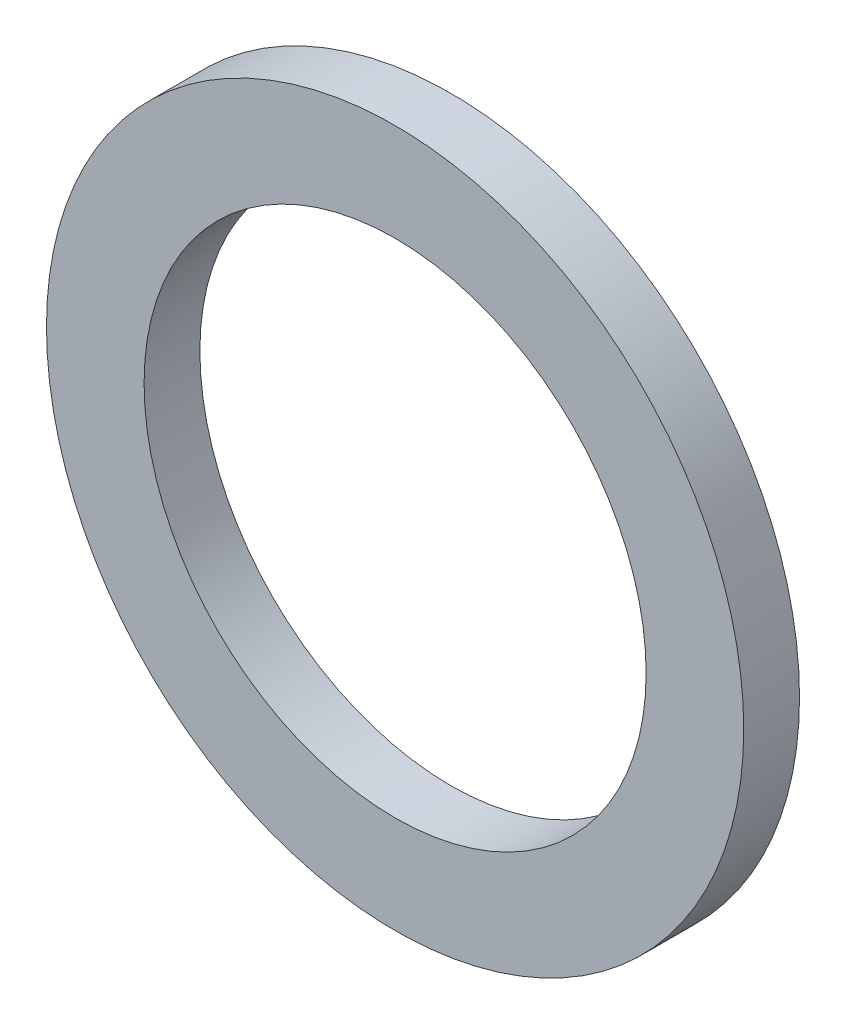
ISO-10303-21;
HEADER;
FILE_DESCRIPTION(('STEP AP214'),'2;1');
FILE_NAME('part.step','',(''),(''),'','','');
FILE_SCHEMA(('AUTOMOTIVE_DESIGN { 1 0 10303 214 1 1 1 1 }'));
ENDSEC;
DATA;
#1=APPLICATION_CONTEXT('core data for automotive mechanical design processes');
#2=APPLICATION_PROTOCOL_DEFINITION('international standard','automotive_design',2000,#1);
#3=PRODUCT_CONTEXT('',#1,'mechanical');
#4=PRODUCT('Part','Part','',(#3));
#5=PRODUCT_RELATED_PRODUCT_CATEGORY('part','',(#4));
#6=PRODUCT_DEFINITION_FORMATION('','',#4);
#7=PRODUCT_DEFINITION_CONTEXT('part definition',#1,'design');
#8=PRODUCT_DEFINITION('design','',#6,#7);
#9=PRODUCT_DEFINITION_SHAPE('','',#8);
#10=(LENGTH_UNIT() NAMED_UNIT(*) SI_UNIT(.MILLI.,.METRE.));
#11=(NAMED_UNIT(*) PLANE_ANGLE_UNIT() SI_UNIT($,.RADIAN.));
#12=(NAMED_UNIT(*) SI_UNIT($,.STERADIAN.) SOLID_ANGLE_UNIT());
#13=UNCERTAINTY_MEASURE_WITH_UNIT(LENGTH_MEASURE(1.E-05),#10,'distance_accuracy_value','');
#14=(GEOMETRIC_REPRESENTATION_CONTEXT(3) GLOBAL_UNCERTAINTY_ASSIGNED_CONTEXT((#13)) GLOBAL_UNIT_ASSIGNED_CONTEXT((#10,
#11,#12)) REPRESENTATION_CONTEXT('',''));
#15=CARTESIAN_POINT('',(0.,0.,0.));
#16=DIRECTION('',(0.,0.,1.));
#17=DIRECTION('',(1.,0.,0.));
#18=AXIS2_PLACEMENT_3D('',#15,#16,#17);
#19=CARTESIAN_POINT('',(0.,0.,0.));
#20=DIRECTION('',(0.,0.,1.));
#21=DIRECTION('',(1.,0.,0.));
#22=AXIS2_PLACEMENT_3D('',#19,#20,#21);
#23=PLANE('',#22);
#24=CARTESIAN_POINT('',(0.,0.,0.));
#25=DIRECTION('',(0.,0.,-1.));
#26=DIRECTION('',(-1.,0.,0.));
#27=AXIS2_PLACEMENT_3D('',#24,#25,#26);
#28=CIRCLE('',#27,5.715);
#29=CARTESIAN_POINT('',(-5.715,0.,0.));
#30=VERTEX_POINT('',#29);
#31=EDGE_CURVE('E26',#30,#30,#28,.F.);
#32=ORIENTED_EDGE('',*,*,#31,.T.);
#33=EDGE_LOOP('',(#32));
#34=FACE_BOUND('',#33,.T.);
#35=CARTESIAN_POINT('',(0.,0.,0.));
#36=DIRECTION('',(0.,0.,-1.));
#37=DIRECTION('',(-1.,0.,0.));
#38=AXIS2_PLACEMENT_3D('',#35,#36,#37);
#39=CIRCLE('',#38,7.9375);
#40=CARTESIAN_POINT('',(-7.9375,0.,0.));
#41=VERTEX_POINT('',#40);
#42=EDGE_CURVE('E17',#41,#41,#39,.F.);
#43=ORIENTED_EDGE('',*,*,#42,.F.);
#44=EDGE_LOOP('',(#43));
#45=FACE_BOUND('',#44,.T.);
#46=ADVANCED_FACE('F14',(#34,#45),#23,.F.);
#47=CARTESIAN_POINT('',(0.,0.,1.27));
#48=DIRECTION('',(0.,0.,-1.));
#49=DIRECTION('',(-1.,0.,0.));
#50=AXIS2_PLACEMENT_3D('',#47,#48,#49);
#51=CYLINDRICAL_SURFACE('',#50,7.9375);
#52=ORIENTED_EDGE('',*,*,#42,.T.);
#53=EDGE_LOOP('',(#52));
#54=FACE_BOUND('',#53,.T.);
#55=CARTESIAN_POINT('',(0.,0.,1.27));
#56=DIRECTION('',(0.,0.,-1.));
#57=DIRECTION('',(-1.,0.,0.));
#58=AXIS2_PLACEMENT_3D('',#55,#56,#57);
#59=CIRCLE('',#58,7.9375);
#60=CARTESIAN_POINT('',(-7.9375,0.,1.27));
#61=VERTEX_POINT('',#60);
#62=EDGE_CURVE('E21',#61,#61,#59,.F.);
#63=ORIENTED_EDGE('',*,*,#62,.F.);
#64=EDGE_LOOP('',(#63));
#65=FACE_BOUND('',#64,.T.);
#66=ADVANCED_FACE('F34',(#54,#65),#51,.T.);
#67=CARTESIAN_POINT('',(0.,0.,1.27));
#68=DIRECTION('',(0.,0.,-1.));
#69=DIRECTION('',(-1.,0.,0.));
#70=AXIS2_PLACEMENT_3D('',#67,#68,#69);
#71=CYLINDRICAL_SURFACE('',#70,5.715);
#72=CARTESIAN_POINT('',(0.,0.,1.27));
#73=DIRECTION('',(0.,0.,-1.));
#74=DIRECTION('',(-1.,0.,0.));
#75=AXIS2_PLACEMENT_3D('',#72,#73,#74);
#76=CIRCLE('',#75,5.715);
#77=CARTESIAN_POINT('',(-5.715,0.,1.27));
#78=VERTEX_POINT('',#77);
#79=EDGE_CURVE('E10',#78,#78,#76,.T.);
#80=ORIENTED_EDGE('',*,*,#79,.F.);
#81=EDGE_LOOP('',(#80));
#82=FACE_BOUND('',#81,.T.);
#83=ORIENTED_EDGE('',*,*,#31,.F.);
#84=EDGE_LOOP('',(#83));
#85=FACE_BOUND('',#84,.T.);
#86=ADVANCED_FACE('F42',(#82,#85),#71,.F.);
#87=CARTESIAN_POINT('',(0.,0.,1.27));
#88=DIRECTION('',(0.,0.,1.));
#89=DIRECTION('',(1.,0.,0.));
#90=AXIS2_PLACEMENT_3D('',#87,#88,#89);
#91=PLANE('',#90);
#92=ORIENTED_EDGE('',*,*,#79,.T.);
#93=EDGE_LOOP('',(#92));
#94=FACE_BOUND('',#93,.T.);
#95=ORIENTED_EDGE('',*,*,#62,.T.);
#96=EDGE_LOOP('',(#95));
#97=FACE_BOUND('',#96,.T.);
#98=ADVANCED_FACE('F43',(#94,#97),#91,.T.);
#99=CLOSED_SHELL('',(#46,#66,#86,#98));
#100=MANIFOLD_SOLID_BREP('B1',#99);
#101=ADVANCED_BREP_SHAPE_REPRESENTATION('',(#18,#100),#14);
#102=SHAPE_DEFINITION_REPRESENTATION(#9,#101);
ENDSEC;
END-ISO-10303-21;
